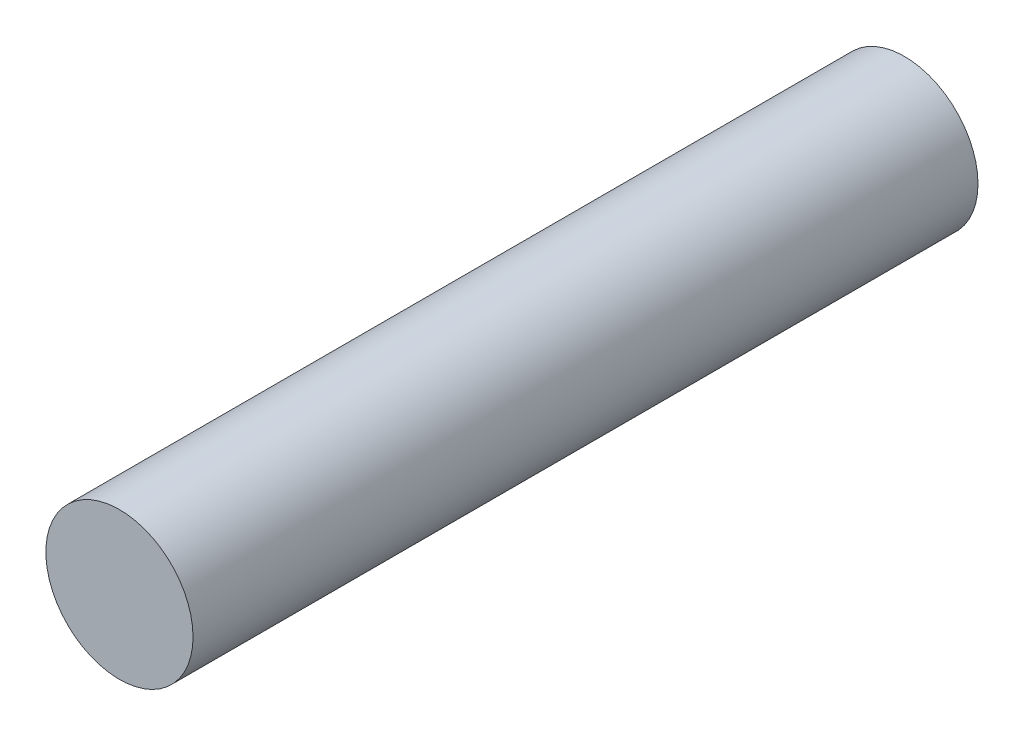
ISO-10303-21;
HEADER;
FILE_DESCRIPTION(('STEP AP214'),'2;1');
FILE_NAME('part.step','',(''),(''),'','','');
FILE_SCHEMA(('AUTOMOTIVE_DESIGN { 1 0 10303 214 1 1 1 1 }'));
ENDSEC;
DATA;
#1=APPLICATION_CONTEXT('core data for automotive mechanical design processes');
#2=APPLICATION_PROTOCOL_DEFINITION('international standard','automotive_design',2000,#1);
#3=PRODUCT_CONTEXT('',#1,'mechanical');
#4=PRODUCT('Part','Part','',(#3));
#5=PRODUCT_RELATED_PRODUCT_CATEGORY('part','',(#4));
#6=PRODUCT_DEFINITION_FORMATION('','',#4);
#7=PRODUCT_DEFINITION_CONTEXT('part definition',#1,'design');
#8=PRODUCT_DEFINITION('design','',#6,#7);
#9=PRODUCT_DEFINITION_SHAPE('','',#8);
#10=(LENGTH_UNIT() NAMED_UNIT(*) SI_UNIT(.MILLI.,.METRE.));
#11=(NAMED_UNIT(*) PLANE_ANGLE_UNIT() SI_UNIT($,.RADIAN.));
#12=(NAMED_UNIT(*) SI_UNIT($,.STERADIAN.) SOLID_ANGLE_UNIT());
#13=UNCERTAINTY_MEASURE_WITH_UNIT(LENGTH_MEASURE(1.E-05),#10,'distance_accuracy_value','');
#14=(GEOMETRIC_REPRESENTATION_CONTEXT(3) GLOBAL_UNCERTAINTY_ASSIGNED_CONTEXT((#13)) GLOBAL_UNIT_ASSIGNED_CONTEXT((#10,
#11,#12)) REPRESENTATION_CONTEXT('',''));
#15=CARTESIAN_POINT('',(0.,0.,0.));
#16=DIRECTION('',(0.,0.,1.));
#17=DIRECTION('',(1.,0.,0.));
#18=AXIS2_PLACEMENT_3D('',#15,#16,#17);
#19=CARTESIAN_POINT('',(0.,0.,50.8));
#20=DIRECTION('',(0.,0.,-1.));
#21=DIRECTION('',(-1.,0.,0.));
#22=AXIS2_PLACEMENT_3D('',#19,#20,#21);
#23=CYLINDRICAL_SURFACE('',#22,4.7625);
#24=CARTESIAN_POINT('',(0.,0.,50.8));
#25=DIRECTION('',(0.,0.,1.));
#26=DIRECTION('',(1.,0.,0.));
#27=AXIS2_PLACEMENT_3D('',#24,#25,#26);
#28=CIRCLE('',#27,4.7625);
#29=CARTESIAN_POINT('',(4.7625,0.,50.8));
#30=VERTEX_POINT('',#29);
#31=EDGE_CURVE('E10',#30,#30,#28,.T.);
#32=ORIENTED_EDGE('',*,*,#31,.F.);
#33=EDGE_LOOP('',(#32));
#34=FACE_BOUND('',#33,.T.);
#35=CARTESIAN_POINT('',(0.,0.,0.));
#36=DIRECTION('',(0.,0.,1.));
#37=DIRECTION('',(1.,0.,0.));
#38=AXIS2_PLACEMENT_3D('',#35,#36,#37);
#39=CIRCLE('',#38,4.7625);
#40=CARTESIAN_POINT('',(4.7625,0.,0.));
#41=VERTEX_POINT('',#40);
#42=EDGE_CURVE('E34',#41,#41,#39,.T.);
#43=ORIENTED_EDGE('',*,*,#42,.T.);
#44=EDGE_LOOP('',(#43));
#45=FACE_BOUND('',#44,.T.);
#46=ADVANCED_FACE('F31',(#34,#45),#23,.T.);
#47=CARTESIAN_POINT('',(0.,0.,50.8));
#48=DIRECTION('',(0.,0.,1.));
#49=DIRECTION('',(1.,0.,0.));
#50=AXIS2_PLACEMENT_3D('',#47,#48,#49);
#51=PLANE('',#50);
#52=ORIENTED_EDGE('',*,*,#31,.T.);
#53=EDGE_LOOP('',(#52));
#54=FACE_BOUND('',#53,.T.);
#55=ADVANCED_FACE('F46',(#54),#51,.T.);
#56=CARTESIAN_POINT('',(0.,0.,0.));
#57=DIRECTION('',(0.,0.,1.));
#58=DIRECTION('',(1.,0.,0.));
#59=AXIS2_PLACEMENT_3D('',#56,#57,#58);
#60=PLANE('',#59);
#61=ORIENTED_EDGE('',*,*,#42,.F.);
#62=EDGE_LOOP('',(#61));
#63=FACE_BOUND('',#62,.T.);
#64=ADVANCED_FACE('F44',(#63),#60,.F.);
#65=CLOSED_SHELL('',(#46,#55,#64));
#66=MANIFOLD_SOLID_BREP('B2',#65);
#67=ADVANCED_BREP_SHAPE_REPRESENTATION('',(#18,#66),#14);
#68=SHAPE_DEFINITION_REPRESENTATION(#9,#67);
ENDSEC;
END-ISO-10303-21;
